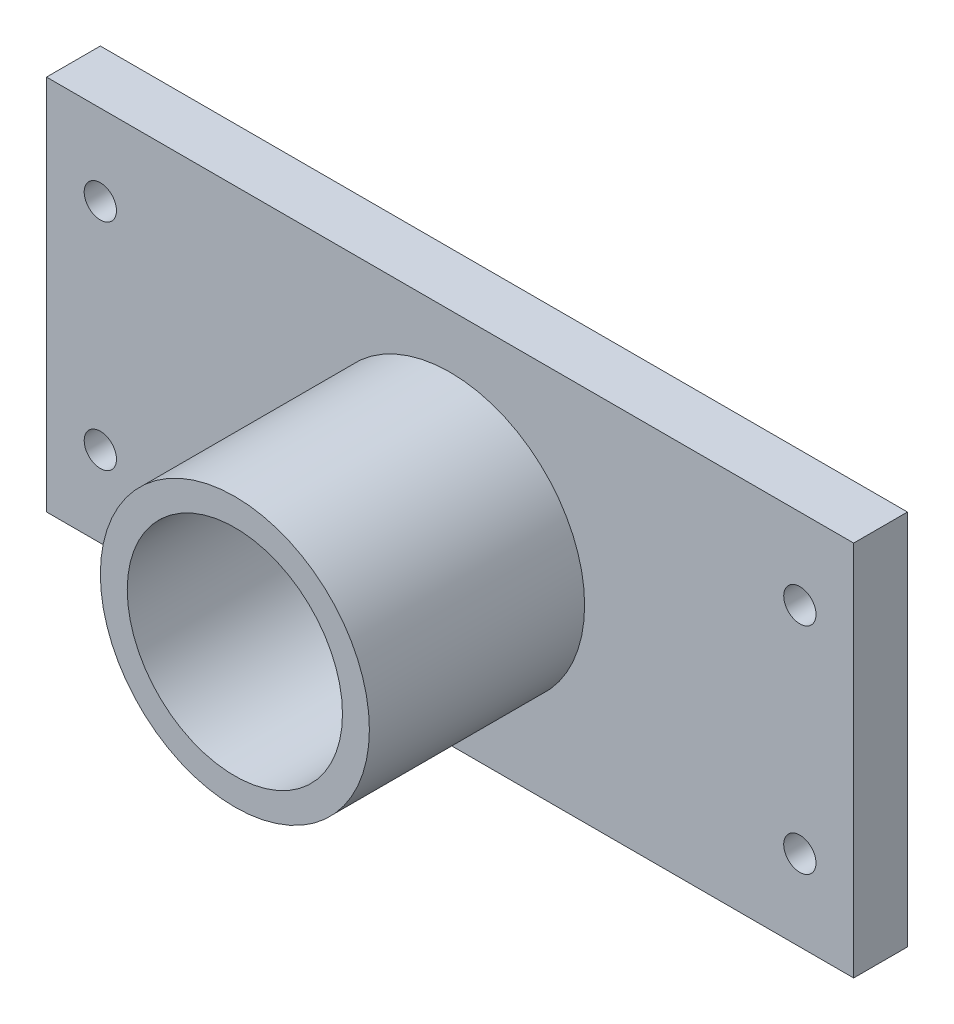
ISO-10303-21;
HEADER;
FILE_DESCRIPTION(('STEP AP214'),'2;1');
FILE_NAME('part.step','',(''),(''),'','','');
FILE_SCHEMA(('AUTOMOTIVE_DESIGN { 1 0 10303 214 1 1 1 1 }'));
ENDSEC;
DATA;
#1=APPLICATION_CONTEXT('core data for automotive mechanical design processes');
#2=APPLICATION_PROTOCOL_DEFINITION('international standard','automotive_design',2000,#1);
#3=PRODUCT_CONTEXT('',#1,'mechanical');
#4=PRODUCT('Part','Part','',(#3));
#5=PRODUCT_RELATED_PRODUCT_CATEGORY('part','',(#4));
#6=PRODUCT_DEFINITION_FORMATION('','',#4);
#7=PRODUCT_DEFINITION_CONTEXT('part definition',#1,'design');
#8=PRODUCT_DEFINITION('design','',#6,#7);
#9=PRODUCT_DEFINITION_SHAPE('','',#8);
#10=(LENGTH_UNIT() NAMED_UNIT(*) SI_UNIT(.MILLI.,.METRE.));
#11=(NAMED_UNIT(*) PLANE_ANGLE_UNIT() SI_UNIT($,.RADIAN.));
#12=(NAMED_UNIT(*) SI_UNIT($,.STERADIAN.) SOLID_ANGLE_UNIT());
#13=UNCERTAINTY_MEASURE_WITH_UNIT(LENGTH_MEASURE(1.E-05),#10,'distance_accuracy_value','');
#14=(GEOMETRIC_REPRESENTATION_CONTEXT(3) GLOBAL_UNCERTAINTY_ASSIGNED_CONTEXT((#13)) GLOBAL_UNIT_ASSIGNED_CONTEXT((#10,
#11,#12)) REPRESENTATION_CONTEXT('',''));
#15=CARTESIAN_POINT('',(0.,0.,0.));
#16=DIRECTION('',(0.,0.,1.));
#17=DIRECTION('',(1.,0.,0.));
#18=AXIS2_PLACEMENT_3D('',#15,#16,#17);
#19=CARTESIAN_POINT('',(0.,0.,10.));
#20=DIRECTION('',(0.,0.,1.));
#21=DIRECTION('',(1.,0.,0.));
#22=AXIS2_PLACEMENT_3D('',#19,#20,#21);
#23=PLANE('',#22);
#24=CARTESIAN_POINT('',(-65.,-20.,10.));
#25=DIRECTION('',(0.,0.,1.));
#26=DIRECTION('',(-1.,0.,0.));
#27=AXIS2_PLACEMENT_3D('',#24,#25,#26);
#28=CIRCLE('',#27,3.);
#29=CARTESIAN_POINT('',(-68.,-20.,10.));
#30=VERTEX_POINT('',#29);
#31=EDGE_CURVE('E147',#30,#30,#28,.T.);
#32=ORIENTED_EDGE('',*,*,#31,.F.);
#33=EDGE_LOOP('',(#32));
#34=FACE_BOUND('',#33,.T.);
#35=CARTESIAN_POINT('',(65.,-20.,10.));
#36=DIRECTION('',(0.,0.,1.));
#37=DIRECTION('',(1.,0.,0.));
#38=AXIS2_PLACEMENT_3D('',#35,#36,#37);
#39=CIRCLE('',#38,3.);
#40=CARTESIAN_POINT('',(68.,-20.,10.));
#41=VERTEX_POINT('',#40);
#42=EDGE_CURVE('E141',#41,#41,#39,.T.);
#43=ORIENTED_EDGE('',*,*,#42,.F.);
#44=EDGE_LOOP('',(#43));
#45=FACE_BOUND('',#44,.T.);
#46=CARTESIAN_POINT('',(65.,20.,10.));
#47=DIRECTION('',(0.,0.,1.));
#48=DIRECTION('',(-1.,0.,0.));
#49=AXIS2_PLACEMENT_3D('',#46,#47,#48);
#50=CIRCLE('',#49,3.);
#51=CARTESIAN_POINT('',(62.,20.,10.));
#52=VERTEX_POINT('',#51);
#53=EDGE_CURVE('E135',#52,#52,#50,.T.);
#54=ORIENTED_EDGE('',*,*,#53,.F.);
#55=EDGE_LOOP('',(#54));
#56=FACE_BOUND('',#55,.T.);
#57=CARTESIAN_POINT('',(-65.,20.,10.));
#58=DIRECTION('',(0.,0.,1.));
#59=DIRECTION('',(1.,0.,0.));
#60=AXIS2_PLACEMENT_3D('',#57,#58,#59);
#61=CIRCLE('',#60,3.);
#62=CARTESIAN_POINT('',(-62.,20.,10.));
#63=VERTEX_POINT('',#62);
#64=EDGE_CURVE('E129',#63,#63,#61,.T.);
#65=ORIENTED_EDGE('',*,*,#64,.F.);
#66=EDGE_LOOP('',(#65));
#67=FACE_BOUND('',#66,.T.);
#68=DIRECTION('',(-1.,0.,0.));
#69=VECTOR('',#68,1.);
#70=CARTESIAN_POINT('',(0.,35.,10.));
#71=LINE('',#70,#69);
#72=CARTESIAN_POINT('',(75.,35.,10.));
#73=VERTEX_POINT('',#72);
#74=CARTESIAN_POINT('',(-75.,35.,10.));
#75=VERTEX_POINT('',#74);
#76=EDGE_CURVE('E90',#73,#75,#71,.T.);
#77=ORIENTED_EDGE('',*,*,#76,.T.);
#78=DIRECTION('',(0.,-1.,0.));
#79=VECTOR('',#78,1.);
#80=CARTESIAN_POINT('',(-75.,0.,10.));
#81=LINE('',#80,#79);
#82=CARTESIAN_POINT('',(-75.,-35.,10.));
#83=VERTEX_POINT('',#82);
#84=EDGE_CURVE('E82',#75,#83,#81,.T.);
#85=ORIENTED_EDGE('',*,*,#84,.T.);
#86=DIRECTION('',(-1.,0.,0.));
#87=VECTOR('',#86,1.);
#88=CARTESIAN_POINT('',(0.,-35.,10.));
#89=LINE('',#88,#87);
#90=CARTESIAN_POINT('',(75.,-35.,10.));
#91=VERTEX_POINT('',#90);
#92=EDGE_CURVE('E89',#91,#83,#89,.T.);
#93=ORIENTED_EDGE('',*,*,#92,.F.);
#94=DIRECTION('',(0.,-1.,0.));
#95=VECTOR('',#94,1.);
#96=CARTESIAN_POINT('',(75.,0.,10.));
#97=LINE('',#96,#95);
#98=EDGE_CURVE('E99',#73,#91,#97,.T.);
#99=ORIENTED_EDGE('',*,*,#98,.F.);
#100=EDGE_LOOP('',(#77,#85,#93,#99));
#101=FACE_BOUND('',#100,.T.);
#102=CARTESIAN_POINT('',(0.,0.,10.));
#103=DIRECTION('',(0.,0.,1.));
#104=DIRECTION('',(1.,0.,0.));
#105=AXIS2_PLACEMENT_3D('',#102,#103,#104);
#106=CIRCLE('',#105,25.);
#107=CARTESIAN_POINT('',(25.,0.,10.));
#108=VERTEX_POINT('',#107);
#109=EDGE_CURVE('E120',#108,#108,#106,.T.);
#110=ORIENTED_EDGE('',*,*,#109,.F.);
#111=EDGE_LOOP('',(#110));
#112=FACE_BOUND('',#111,.T.);
#113=ADVANCED_FACE('F40',(#34,#45,#56,#67,#101,#112),#23,.T.);
#114=CARTESIAN_POINT('',(0.,35.,10.));
#115=DIRECTION('',(0.,-1.,0.));
#116=DIRECTION('',(1.,0.,0.));
#117=AXIS2_PLACEMENT_3D('',#114,#115,#116);
#118=PLANE('',#117);
#119=DIRECTION('',(-1.,0.,0.));
#120=VECTOR('',#119,1.);
#121=CARTESIAN_POINT('',(0.,35.,0.));
#122=LINE('',#121,#120);
#123=CARTESIAN_POINT('',(75.,35.,0.));
#124=VERTEX_POINT('',#123);
#125=CARTESIAN_POINT('',(-75.,35.,0.));
#126=VERTEX_POINT('',#125);
#127=EDGE_CURVE('E104',#124,#126,#122,.T.);
#128=ORIENTED_EDGE('',*,*,#127,.T.);
#129=DIRECTION('',(0.,0.,-1.));
#130=VECTOR('',#129,1.);
#131=CARTESIAN_POINT('',(-75.,35.,10.));
#132=LINE('',#131,#130);
#133=EDGE_CURVE('E12',#75,#126,#132,.T.);
#134=ORIENTED_EDGE('',*,*,#133,.F.);
#135=ORIENTED_EDGE('',*,*,#76,.F.);
#136=DIRECTION('',(0.,0.,-1.));
#137=VECTOR('',#136,1.);
#138=CARTESIAN_POINT('',(75.,35.,10.));
#139=LINE('',#138,#137);
#140=EDGE_CURVE('E57',#73,#124,#139,.T.);
#141=ORIENTED_EDGE('',*,*,#140,.T.);
#142=EDGE_LOOP('',(#128,#134,#135,#141));
#143=FACE_BOUND('',#142,.T.);
#144=ADVANCED_FACE('F42',(#143),#118,.F.);
#145=CARTESIAN_POINT('',(-75.,0.,10.));
#146=DIRECTION('',(1.,0.,0.));
#147=DIRECTION('',(0.,1.,0.));
#148=AXIS2_PLACEMENT_3D('',#145,#146,#147);
#149=PLANE('',#148);
#150=DIRECTION('',(0.,-1.,0.));
#151=VECTOR('',#150,1.);
#152=CARTESIAN_POINT('',(-75.,0.,0.));
#153=LINE('',#152,#151);
#154=CARTESIAN_POINT('',(-75.,-35.,0.));
#155=VERTEX_POINT('',#154);
#156=EDGE_CURVE('E95',#126,#155,#153,.T.);
#157=ORIENTED_EDGE('',*,*,#156,.T.);
#158=DIRECTION('',(0.,0.,-1.));
#159=VECTOR('',#158,1.);
#160=CARTESIAN_POINT('',(-75.,-35.,10.));
#161=LINE('',#160,#159);
#162=EDGE_CURVE('E49',#83,#155,#161,.T.);
#163=ORIENTED_EDGE('',*,*,#162,.F.);
#164=ORIENTED_EDGE('',*,*,#84,.F.);
#165=ORIENTED_EDGE('',*,*,#133,.T.);
#166=EDGE_LOOP('',(#157,#163,#164,#165));
#167=FACE_BOUND('',#166,.T.);
#168=ADVANCED_FACE('F94',(#167),#149,.F.);
#169=CARTESIAN_POINT('',(0.,-35.,10.));
#170=DIRECTION('',(0.,-1.,0.));
#171=DIRECTION('',(1.,0.,0.));
#172=AXIS2_PLACEMENT_3D('',#169,#170,#171);
#173=PLANE('',#172);
#174=DIRECTION('',(-1.,0.,0.));
#175=VECTOR('',#174,1.);
#176=CARTESIAN_POINT('',(0.,-35.,0.));
#177=LINE('',#176,#175);
#178=CARTESIAN_POINT('',(75.,-35.,0.));
#179=VERTEX_POINT('',#178);
#180=EDGE_CURVE('E108',#179,#155,#177,.T.);
#181=ORIENTED_EDGE('',*,*,#180,.F.);
#182=DIRECTION('',(0.,0.,-1.));
#183=VECTOR('',#182,1.);
#184=CARTESIAN_POINT('',(75.,-35.,10.));
#185=LINE('',#184,#183);
#186=EDGE_CURVE('E71',#91,#179,#185,.T.);
#187=ORIENTED_EDGE('',*,*,#186,.F.);
#188=ORIENTED_EDGE('',*,*,#92,.T.);
#189=ORIENTED_EDGE('',*,*,#162,.T.);
#190=EDGE_LOOP('',(#181,#187,#188,#189));
#191=FACE_BOUND('',#190,.T.);
#192=ADVANCED_FACE('F98',(#191),#173,.T.);
#193=CARTESIAN_POINT('',(75.,0.,10.));
#194=DIRECTION('',(1.,0.,0.));
#195=DIRECTION('',(0.,1.,0.));
#196=AXIS2_PLACEMENT_3D('',#193,#194,#195);
#197=PLANE('',#196);
#198=DIRECTION('',(0.,-1.,0.));
#199=VECTOR('',#198,1.);
#200=CARTESIAN_POINT('',(75.,0.,0.));
#201=LINE('',#200,#199);
#202=EDGE_CURVE('E110',#124,#179,#201,.T.);
#203=ORIENTED_EDGE('',*,*,#202,.F.);
#204=ORIENTED_EDGE('',*,*,#140,.F.);
#205=ORIENTED_EDGE('',*,*,#98,.T.);
#206=ORIENTED_EDGE('',*,*,#186,.T.);
#207=EDGE_LOOP('',(#203,#204,#205,#206));
#208=FACE_BOUND('',#207,.T.);
#209=ADVANCED_FACE('F198',(#208),#197,.T.);
#210=CARTESIAN_POINT('',(0.,0.,10.));
#211=DIRECTION('',(0.,0.,-1.));
#212=DIRECTION('',(-1.,0.,0.));
#213=AXIS2_PLACEMENT_3D('',#210,#211,#212);
#214=CYLINDRICAL_SURFACE('',#213,20.);
#215=CARTESIAN_POINT('',(0.,0.,0.));
#216=DIRECTION('',(0.,0.,1.));
#217=DIRECTION('',(1.,0.,0.));
#218=AXIS2_PLACEMENT_3D('',#215,#216,#217);
#219=CIRCLE('',#218,20.);
#220=CARTESIAN_POINT('',(20.,0.,0.));
#221=VERTEX_POINT('',#220);
#222=EDGE_CURVE('E113',#221,#221,#219,.T.);
#223=ORIENTED_EDGE('',*,*,#222,.F.);
#224=EDGE_LOOP('',(#223));
#225=FACE_BOUND('',#224,.T.);
#226=CARTESIAN_POINT('',(0.,0.,50.));
#227=DIRECTION('',(0.,0.,1.));
#228=DIRECTION('',(1.,0.,0.));
#229=AXIS2_PLACEMENT_3D('',#226,#227,#228);
#230=CIRCLE('',#229,20.);
#231=CARTESIAN_POINT('',(20.,0.,50.));
#232=VERTEX_POINT('',#231);
#233=EDGE_CURVE('E123',#232,#232,#230,.T.);
#234=ORIENTED_EDGE('',*,*,#233,.T.);
#235=EDGE_LOOP('',(#234));
#236=FACE_BOUND('',#235,.T.);
#237=ADVANCED_FACE('F195',(#225,#236),#214,.F.);
#238=CARTESIAN_POINT('',(0.,0.,0.));
#239=DIRECTION('',(0.,0.,1.));
#240=DIRECTION('',(1.,0.,0.));
#241=AXIS2_PLACEMENT_3D('',#238,#239,#240);
#242=PLANE('',#241);
#243=CARTESIAN_POINT('',(-65.,-20.,0.));
#244=DIRECTION('',(0.,0.,1.));
#245=DIRECTION('',(-1.,0.,0.));
#246=AXIS2_PLACEMENT_3D('',#243,#244,#245);
#247=CIRCLE('',#246,3.);
#248=CARTESIAN_POINT('',(-68.,-20.,0.));
#249=VERTEX_POINT('',#248);
#250=EDGE_CURVE('E132',#249,#249,#247,.T.);
#251=ORIENTED_EDGE('',*,*,#250,.T.);
#252=EDGE_LOOP('',(#251));
#253=FACE_BOUND('',#252,.T.);
#254=CARTESIAN_POINT('',(65.,-20.,0.));
#255=DIRECTION('',(0.,0.,1.));
#256=DIRECTION('',(1.,0.,0.));
#257=AXIS2_PLACEMENT_3D('',#254,#255,#256);
#258=CIRCLE('',#257,3.);
#259=CARTESIAN_POINT('',(68.,-20.,0.));
#260=VERTEX_POINT('',#259);
#261=EDGE_CURVE('E144',#260,#260,#258,.T.);
#262=ORIENTED_EDGE('',*,*,#261,.T.);
#263=EDGE_LOOP('',(#262));
#264=FACE_BOUND('',#263,.T.);
#265=CARTESIAN_POINT('',(65.,20.,0.));
#266=DIRECTION('',(0.,0.,1.));
#267=DIRECTION('',(-1.,0.,0.));
#268=AXIS2_PLACEMENT_3D('',#265,#266,#267);
#269=CIRCLE('',#268,3.);
#270=CARTESIAN_POINT('',(62.,20.,0.));
#271=VERTEX_POINT('',#270);
#272=EDGE_CURVE('E138',#271,#271,#269,.T.);
#273=ORIENTED_EDGE('',*,*,#272,.T.);
#274=EDGE_LOOP('',(#273));
#275=FACE_BOUND('',#274,.T.);
#276=CARTESIAN_POINT('',(-65.,20.,0.));
#277=DIRECTION('',(0.,0.,1.));
#278=DIRECTION('',(1.,0.,0.));
#279=AXIS2_PLACEMENT_3D('',#276,#277,#278);
#280=CIRCLE('',#279,3.);
#281=CARTESIAN_POINT('',(-62.,20.,0.));
#282=VERTEX_POINT('',#281);
#283=EDGE_CURVE('E128',#282,#282,#280,.T.);
#284=ORIENTED_EDGE('',*,*,#283,.T.);
#285=EDGE_LOOP('',(#284));
#286=FACE_BOUND('',#285,.T.);
#287=ORIENTED_EDGE('',*,*,#127,.F.);
#288=ORIENTED_EDGE('',*,*,#202,.T.);
#289=ORIENTED_EDGE('',*,*,#180,.T.);
#290=ORIENTED_EDGE('',*,*,#156,.F.);
#291=EDGE_LOOP('',(#287,#288,#289,#290));
#292=FACE_BOUND('',#291,.T.);
#293=ORIENTED_EDGE('',*,*,#222,.T.);
#294=EDGE_LOOP('',(#293));
#295=FACE_BOUND('',#294,.T.);
#296=ADVANCED_FACE('F153',(#253,#264,#275,#286,#292,#295),#242,.F.);
#297=CARTESIAN_POINT('',(0.,0.,50.));
#298=DIRECTION('',(0.,0.,1.));
#299=DIRECTION('',(1.,0.,0.));
#300=AXIS2_PLACEMENT_3D('',#297,#298,#299);
#301=PLANE('',#300);
#302=CARTESIAN_POINT('',(0.,0.,50.));
#303=DIRECTION('',(0.,0.,1.));
#304=DIRECTION('',(1.,0.,0.));
#305=AXIS2_PLACEMENT_3D('',#302,#303,#304);
#306=CIRCLE('',#305,25.);
#307=CARTESIAN_POINT('',(25.,0.,50.));
#308=VERTEX_POINT('',#307);
#309=EDGE_CURVE('E106',#308,#308,#306,.T.);
#310=ORIENTED_EDGE('',*,*,#309,.T.);
#311=EDGE_LOOP('',(#310));
#312=FACE_BOUND('',#311,.T.);
#313=ORIENTED_EDGE('',*,*,#233,.F.);
#314=EDGE_LOOP('',(#313));
#315=FACE_BOUND('',#314,.T.);
#316=ADVANCED_FACE('F184',(#312,#315),#301,.T.);
#317=CARTESIAN_POINT('',(0.,0.,50.));
#318=DIRECTION('',(0.,0.,-1.));
#319=DIRECTION('',(-1.,0.,0.));
#320=AXIS2_PLACEMENT_3D('',#317,#318,#319);
#321=CYLINDRICAL_SURFACE('',#320,25.);
#322=ORIENTED_EDGE('',*,*,#309,.F.);
#323=EDGE_LOOP('',(#322));
#324=FACE_BOUND('',#323,.T.);
#325=ORIENTED_EDGE('',*,*,#109,.T.);
#326=EDGE_LOOP('',(#325));
#327=FACE_BOUND('',#326,.T.);
#328=ADVANCED_FACE('F175',(#324,#327),#321,.T.);
#329=CARTESIAN_POINT('',(-65.,20.,0.));
#330=DIRECTION('',(0.,0.,1.));
#331=DIRECTION('',(1.,0.,0.));
#332=AXIS2_PLACEMENT_3D('',#329,#330,#331);
#333=CYLINDRICAL_SURFACE('',#332,3.);
#334=ORIENTED_EDGE('',*,*,#283,.F.);
#335=EDGE_LOOP('',(#334));
#336=FACE_BOUND('',#335,.T.);
#337=ORIENTED_EDGE('',*,*,#64,.T.);
#338=EDGE_LOOP('',(#337));
#339=FACE_BOUND('',#338,.T.);
#340=ADVANCED_FACE('F172',(#336,#339),#333,.F.);
#341=CARTESIAN_POINT('',(65.,20.,0.));
#342=DIRECTION('',(0.,0.,1.));
#343=DIRECTION('',(1.,0.,0.));
#344=AXIS2_PLACEMENT_3D('',#341,#342,#343);
#345=CYLINDRICAL_SURFACE('',#344,3.);
#346=ORIENTED_EDGE('',*,*,#272,.F.);
#347=EDGE_LOOP('',(#346));
#348=FACE_BOUND('',#347,.T.);
#349=ORIENTED_EDGE('',*,*,#53,.T.);
#350=EDGE_LOOP('',(#349));
#351=FACE_BOUND('',#350,.T.);
#352=ADVANCED_FACE('F174',(#348,#351),#345,.F.);
#353=CARTESIAN_POINT('',(65.,-20.,0.));
#354=DIRECTION('',(0.,0.,1.));
#355=DIRECTION('',(1.,0.,0.));
#356=AXIS2_PLACEMENT_3D('',#353,#354,#355);
#357=CYLINDRICAL_SURFACE('',#356,3.);
#358=ORIENTED_EDGE('',*,*,#261,.F.);
#359=EDGE_LOOP('',(#358));
#360=FACE_BOUND('',#359,.T.);
#361=ORIENTED_EDGE('',*,*,#42,.T.);
#362=EDGE_LOOP('',(#361));
#363=FACE_BOUND('',#362,.T.);
#364=ADVANCED_FACE('F159',(#360,#363),#357,.F.);
#365=CARTESIAN_POINT('',(-65.,-20.,0.));
#366=DIRECTION('',(0.,0.,1.));
#367=DIRECTION('',(1.,0.,0.));
#368=AXIS2_PLACEMENT_3D('',#365,#366,#367);
#369=CYLINDRICAL_SURFACE('',#368,3.);
#370=ORIENTED_EDGE('',*,*,#250,.F.);
#371=EDGE_LOOP('',(#370));
#372=FACE_BOUND('',#371,.T.);
#373=ORIENTED_EDGE('',*,*,#31,.T.);
#374=EDGE_LOOP('',(#373));
#375=FACE_BOUND('',#374,.T.);
#376=ADVANCED_FACE('F156',(#372,#375),#369,.F.);
#377=CLOSED_SHELL('',(#113,#144,#168,#192,#209,#237,#296,#316,#328,#340,#352,#364,#376));
#378=MANIFOLD_SOLID_BREP('B2',#377);
#379=ADVANCED_BREP_SHAPE_REPRESENTATION('',(#18,#378),#14);
#380=SHAPE_DEFINITION_REPRESENTATION(#9,#379);
ENDSEC;
END-ISO-10303-21;
